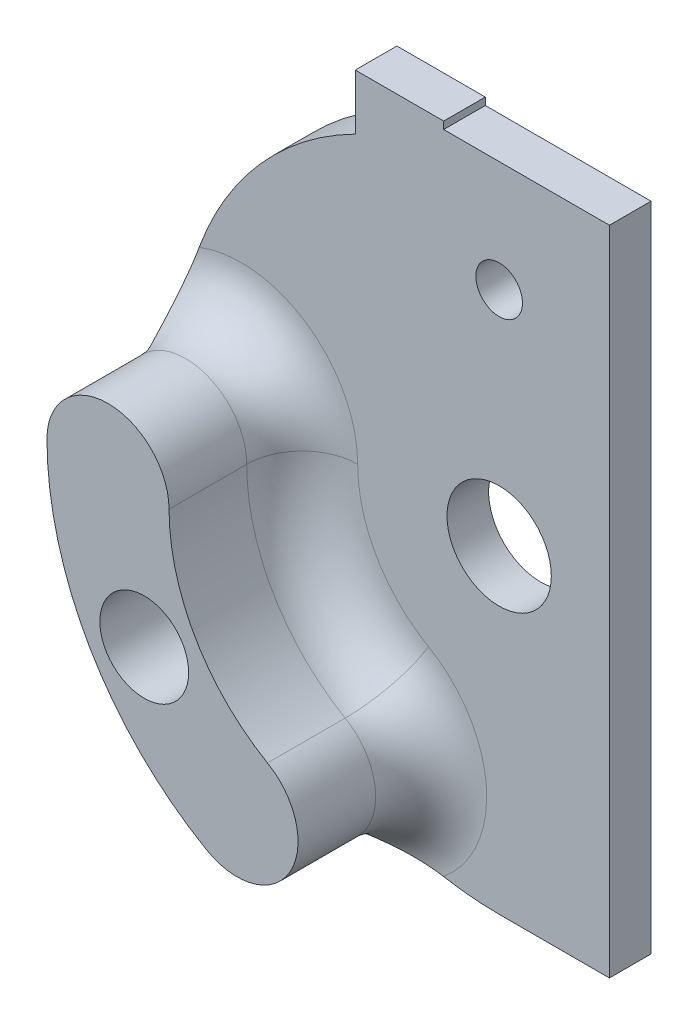
ISO-10303-21;
HEADER;
FILE_DESCRIPTION(('STEP AP214'),'2;1');
FILE_NAME('part.step','',(''),(''),'','','');
FILE_SCHEMA(('AUTOMOTIVE_DESIGN { 1 0 10303 214 1 1 1 1 }'));
ENDSEC;
DATA;
#1=APPLICATION_CONTEXT('core data for automotive mechanical design processes');
#2=APPLICATION_PROTOCOL_DEFINITION('international standard','automotive_design',2000,#1);
#3=PRODUCT_CONTEXT('',#1,'mechanical');
#4=PRODUCT('Part','Part','',(#3));
#5=PRODUCT_RELATED_PRODUCT_CATEGORY('part','',(#4));
#6=PRODUCT_DEFINITION_FORMATION('','',#4);
#7=PRODUCT_DEFINITION_CONTEXT('part definition',#1,'design');
#8=PRODUCT_DEFINITION('design','',#6,#7);
#9=PRODUCT_DEFINITION_SHAPE('','',#8);
#10=(LENGTH_UNIT() NAMED_UNIT(*) SI_UNIT(.MILLI.,.METRE.));
#11=(NAMED_UNIT(*) PLANE_ANGLE_UNIT() SI_UNIT($,.RADIAN.));
#12=(NAMED_UNIT(*) SI_UNIT($,.STERADIAN.) SOLID_ANGLE_UNIT());
#13=UNCERTAINTY_MEASURE_WITH_UNIT(LENGTH_MEASURE(1.E-05),#10,'distance_accuracy_value','');
#14=(GEOMETRIC_REPRESENTATION_CONTEXT(3) GLOBAL_UNCERTAINTY_ASSIGNED_CONTEXT((#13)) GLOBAL_UNIT_ASSIGNED_CONTEXT((#10,
#11,#12)) REPRESENTATION_CONTEXT('',''));
#15=CARTESIAN_POINT('',(0.,0.,0.));
#16=DIRECTION('',(0.,0.,1.));
#17=DIRECTION('',(1.,0.,0.));
#18=AXIS2_PLACEMENT_3D('',#15,#16,#17);
#19=CARTESIAN_POINT('',(0.,0.,4.7625));
#20=DIRECTION('',(0.,0.,-1.));
#21=DIRECTION('',(-1.,0.,0.));
#22=AXIS2_PLACEMENT_3D('',#19,#20,#21);
#23=CYLINDRICAL_SURFACE('',#22,36.5125);
#24=CARTESIAN_POINT('',(0.,0.,0.));
#25=DIRECTION('',(0.,0.,1.));
#26=DIRECTION('',(-1.,0.,0.));
#27=AXIS2_PLACEMENT_3D('',#24,#25,#26);
#28=CIRCLE('',#27,36.5125);
#29=CARTESIAN_POINT('',(-16.4676572466673,32.5880180596532,0.));
#30=VERTEX_POINT('',#29);
#31=CARTESIAN_POINT('',(-0.0815925544444594,-36.5124088346011,0.));
#32=VERTEX_POINT('',#31);
#33=EDGE_CURVE('E180',#30,#32,#28,.T.);
#34=ORIENTED_EDGE('',*,*,#33,.T.);
#35=DIRECTION('',(0.,0.,-1.));
#36=VECTOR('',#35,1.);
#37=CARTESIAN_POINT('',(-0.0815925544444594,-36.5124088346011,4.7625));
#38=LINE('',#37,#36);
#39=CARTESIAN_POINT('',(-0.0815925544444594,-36.5124088346011,4.7625));
#40=VERTEX_POINT('',#39);
#41=EDGE_CURVE('E256',#40,#32,#38,.T.);
#42=ORIENTED_EDGE('',*,*,#41,.F.);
#43=CARTESIAN_POINT('',(0.,0.,4.7625));
#44=DIRECTION('',(0.,0.,1.));
#45=DIRECTION('',(-1.,0.,0.));
#46=AXIS2_PLACEMENT_3D('',#43,#44,#45);
#47=CIRCLE('',#46,36.5125);
#48=CARTESIAN_POINT('',(-6.38944248691626,-35.9490984720951,4.7625));
#49=VERTEX_POINT('',#48);
#50=EDGE_CURVE('E193',#49,#40,#47,.T.);
#51=ORIENTED_EDGE('',*,*,#50,.F.);
#52=CARTESIAN_POINT('',(-6.38944248691626,-35.9490984720951,4.7625));
#53=CARTESIAN_POINT('',(-6.6545339060613,-35.9020014871438,4.76249052092779));
#54=CARTESIAN_POINT('',(-6.9190271908852,-35.8519482461494,4.77224529774474));
#55=CARTESIAN_POINT('',(-7.44536044638756,-35.7463407937768,4.81029895188119));
#56=CARTESIAN_POINT('',(-7.70720236473788,-35.6907910009395,4.83858303513093));
#57=CARTESIAN_POINT('',(-8.22544012186241,-35.5749197597776,4.91246271850194));
#58=CARTESIAN_POINT('',(-8.48186084629677,-35.514633210094,4.95793966788217));
#59=CARTESIAN_POINT('',(-8.99016299446811,-35.3893794261735,5.06521329952242));
#60=CARTESIAN_POINT('',(-9.24204286765562,-35.3244106295826,5.12701544761656));
#61=CARTESIAN_POINT('',(-9.87876915539309,-35.1530013454512,5.30445456861729));
#62=CARTESIAN_POINT('',(-10.2598232764579,-35.0435567990464,5.43093291758837));
#63=CARTESIAN_POINT('',(-11.0067910476253,-34.8161722324103,5.71669360293857));
#64=CARTESIAN_POINT('',(-11.3726987829703,-34.6982289417348,5.87598861196937));
#65=CARTESIAN_POINT('',(-12.0895157369509,-34.4550436978601,6.22365666363656));
#66=CARTESIAN_POINT('',(-12.4403685180986,-34.3297778433316,6.41212866790243));
#67=CARTESIAN_POINT('',(-13.1257718208696,-34.0736072573275,6.81339781991976));
#68=CARTESIAN_POINT('',(-13.4603165670407,-33.9427005586398,7.02620349739124));
#69=CARTESIAN_POINT('',(-14.1976149208928,-33.6420440838603,7.52887639142249));
#70=CARTESIAN_POINT('',(-14.5958638964103,-33.4709408998019,7.8245121086909));
#71=CARTESIAN_POINT('',(-15.3710036607559,-33.1221328685265,8.43890604067875));
#72=CARTESIAN_POINT('',(-15.747887735729,-32.9444259748398,8.75767145287072));
#73=CARTESIAN_POINT('',(-16.4844437668799,-32.5821139225435,9.41006251419565));
#74=CARTESIAN_POINT('',(-16.8441268353738,-32.3975133585686,9.74367829305017));
#75=CARTESIAN_POINT('',(-17.5516423015803,-32.0197334816489,10.4183215436118));
#76=CARTESIAN_POINT('',(-17.899476622143,-31.8265555724951,10.7593477978702));
#77=CARTESIAN_POINT('',(-18.2481027276565,-31.6254553306226,11.1044340879532));
#78=CARTESIAN_POINT('',(-18.2521765911681,-31.6231043337756,11.1084670451463));
#79=CARTESIAN_POINT('',(-18.2562499999999,-31.6207525556794,11.1125));
#80=B_SPLINE_CURVE_WITH_KNOTS('',3,(#52,#53,#54,#55,#56,#57,#58,#59,#60,#61,#62,#63,#64,#65,#66,
#67,#68,#69,#70,#71,#72,#73,#74,#75,#76,#77,#78,#79),.UNSPECIFIED.,.F.,.F.,(4,2,2,2,2,2,2,2,2,2,
2,2,2,4),(0.,0.807429189089032,1.61421449927493,2.41553078612089,3.21711570219748,
4.46359897619903,5.71056450397258,6.96185606189347,8.21358758938861,9.78626418852273,
11.359432287678,12.9315699550436,14.5034512638403,14.522038749716),.UNSPECIFIED.);
#81=CARTESIAN_POINT('',(-18.2562499999999,-31.6207525556794,11.1125));
#82=VERTEX_POINT('',#81);
#83=EDGE_CURVE('E50',#49,#82,#80,.T.);
#84=ORIENTED_EDGE('',*,*,#83,.T.);
#85=DIRECTION('',(0.,0.,-1.));
#86=VECTOR('',#85,1.);
#87=CARTESIAN_POINT('',(-18.2562499999999,-31.6207525556794,20.0025));
#88=LINE('',#87,#86);
#89=CARTESIAN_POINT('',(-18.2562499999999,-31.6207525556794,20.0025));
#90=VERTEX_POINT('',#89);
#91=EDGE_CURVE('E145',#90,#82,#88,.T.);
#92=ORIENTED_EDGE('',*,*,#91,.F.);
#93=CARTESIAN_POINT('',(0.,0.,20.0025));
#94=DIRECTION('',(0.,0.,1.));
#95=DIRECTION('',(-1.,0.,0.));
#96=AXIS2_PLACEMENT_3D('',#93,#94,#95);
#97=CIRCLE('',#96,36.5125);
#98=CARTESIAN_POINT('',(-36.5125,0.,20.0025));
#99=VERTEX_POINT('',#98);
#100=EDGE_CURVE('E152',#99,#90,#97,.T.);
#101=ORIENTED_EDGE('',*,*,#100,.F.);
#102=DIRECTION('',(0.,0.,-1.));
#103=VECTOR('',#102,1.);
#104=CARTESIAN_POINT('',(-36.5125,0.,20.0025));
#105=LINE('',#104,#103);
#106=CARTESIAN_POINT('',(-36.5125,0.,11.1125));
#107=VERTEX_POINT('',#106);
#108=EDGE_CURVE('E380',#99,#107,#105,.T.);
#109=ORIENTED_EDGE('',*,*,#108,.T.);
#110=CARTESIAN_POINT('',(-34.3275537634409,12.4411297263583,4.7625));
#111=CARTESIAN_POINT('',(-34.4193122876035,12.188005330579,4.76249052092779));
#112=CARTESIAN_POINT('',(-34.5082115517721,11.9339208062951,4.77224529774465));
#113=CARTESIAN_POINT('',(-34.6799194429389,11.4252991099897,4.81029895188074));
#114=CARTESIAN_POINT('',(-34.7627328703416,11.1707624605052,4.83858303513021));
#115=CARTESIAN_POINT('',(-34.9215043104897,10.6640197770542,4.91246271850087));
#116=CARTESIAN_POINT('',(-34.9975049891749,10.4118096407943,4.9579396678812));
#117=CARTESIAN_POINT('',(-35.143183104466,9.90898017571699,5.0652132995218));
#118=CARTESIAN_POINT('',(-35.2128584127591,9.65836140853791,5.12701544761622));
#119=CARTESIAN_POINT('',(-35.3827767621262,9.02123562603154,5.30445456861768));
#120=CARTESIAN_POINT('',(-35.4785220651667,8.63651080376886,5.43093291758928));
#121=CARTESIAN_POINT('',(-35.6550851396156,7.87592545480918,5.71669360294068));
#122=CARTESIAN_POINT('',(-35.7358971213573,7.50006841522025,5.87598861197214));
#123=CARTESIAN_POINT('',(-35.8837009993263,6.75769410127262,6.22365666363964));
#124=CARTESIAN_POINT('',(-35.9506439776515,6.39121375254728,6.41212866790495));
#125=CARTESIAN_POINT('',(-36.0714953938546,5.6695517875103,6.81339781992122));
#126=CARTESIAN_POINT('',(-36.1253992403509,5.31437418928102,7.02620349739219));
#127=CARTESIAN_POINT('',(-36.2336722723054,4.52552684728798,7.52887639142204));
#128=CARTESIAN_POINT('',(-36.2846170560012,4.09508152542898,7.82451210868939));
#129=CARTESIAN_POINT('',(-36.3701103220453,3.24938678238783,8.43890604067846));
#130=CARTESIAN_POINT('',(-36.4046536751714,2.83414215233969,8.75767145287267));
#131=CARTESIAN_POINT('',(-36.4591602493611,2.01510989189743,9.41006251418854));
#132=CARTESIAN_POINT('',(-36.479133005653,1.61131493527254,9.74367829303182));
#133=CARTESIAN_POINT('',(-36.5057237683051,0.809698629533392,10.4183215436265));
#134=CARTESIAN_POINT('',(-36.5123439518091,0.411876317077475,10.7593477979292));
#135=CARTESIAN_POINT('',(-36.5124990863974,0.00940713229352854,11.1044340879548));
#136=CARTESIAN_POINT('',(-36.5124999951595,0.004703564576973,11.1084670451471));
#137=CARTESIAN_POINT('',(-36.5125,0.,11.1125));
#138=B_SPLINE_CURVE_WITH_KNOTS('',3,(#110,#111,#112,#113,#114,#115,#116,#117,#118,#119,#120,
#121,#122,#123,#124,#125,#126,#127,#128,#129,#130,#131,#132,#133,#134,#135,#136,#137),
.UNSPECIFIED.,.F.,.F.,(4,2,2,2,2,2,2,2,2,2,2,2,2,4),(0.,0.80742918908523,1.61421449926715,
2.41553078611691,3.21711570219748,4.46359897620353,5.71056450398094,6.96185606189759,
8.21358758938862,9.7862641885217,11.3594322876729,12.9315699550405,14.5034512638407,
14.522038749716),.UNSPECIFIED.);
#139=CARTESIAN_POINT('',(-34.3275537634409,12.4411297263583,4.7625));
#140=VERTEX_POINT('',#139);
#141=EDGE_CURVE('E11',#107,#140,#138,.F.);
#142=ORIENTED_EDGE('',*,*,#141,.T.);
#143=CARTESIAN_POINT('',(-16.4676572466673,32.5880180596532,4.7625));
#144=VERTEX_POINT('',#143);
#145=EDGE_CURVE('E188',#144,#140,#47,.T.);
#146=ORIENTED_EDGE('',*,*,#145,.F.);
#147=DIRECTION('',(0.,0.,-1.));
#148=VECTOR('',#147,1.);
#149=CARTESIAN_POINT('',(-16.4676572466673,32.5880180596532,4.7625));
#150=LINE('',#149,#148);
#151=EDGE_CURVE('E211',#144,#30,#150,.T.);
#152=ORIENTED_EDGE('',*,*,#151,.T.);
#153=EDGE_LOOP('',(#34,#42,#51,#84,#92,#101,#109,#142,#146,#152));
#154=FACE_BOUND('',#153,.T.);
#155=ADVANCED_FACE('F39',(#154),#23,.T.);
#156=CARTESIAN_POINT('',(-0.0815925544444594,-36.5124088346011,4.7625));
#157=DIRECTION('',(0.,1.,0.));
#158=DIRECTION('',(0.,0.,1.));
#159=AXIS2_PLACEMENT_3D('',#156,#157,#158);
#160=PLANE('',#159);
#161=DIRECTION('',(1.,0.,0.));
#162=VECTOR('',#161,1.);
#163=CARTESIAN_POINT('',(-0.0815925544444594,-36.5124088346011,0.));
#164=LINE('',#163,#162);
#165=CARTESIAN_POINT('',(12.6184074455555,-36.5124088346011,0.));
#166=VERTEX_POINT('',#165);
#167=EDGE_CURVE('E214',#32,#166,#164,.T.);
#168=ORIENTED_EDGE('',*,*,#167,.T.);
#169=DIRECTION('',(0.,0.,-1.));
#170=VECTOR('',#169,1.);
#171=CARTESIAN_POINT('',(12.6184074455555,-36.5124088346011,4.7625));
#172=LINE('',#171,#170);
#173=CARTESIAN_POINT('',(12.6184074455555,-36.5124088346011,4.7625));
#174=VERTEX_POINT('',#173);
#175=EDGE_CURVE('E252',#174,#166,#172,.T.);
#176=ORIENTED_EDGE('',*,*,#175,.F.);
#177=DIRECTION('',(1.,0.,0.));
#178=VECTOR('',#177,1.);
#179=CARTESIAN_POINT('',(-0.0815925544444594,-36.5124088346011,4.7625));
#180=LINE('',#179,#178);
#181=EDGE_CURVE('E192',#40,#174,#180,.T.);
#182=ORIENTED_EDGE('',*,*,#181,.F.);
#183=ORIENTED_EDGE('',*,*,#41,.T.);
#184=EDGE_LOOP('',(#168,#176,#182,#183));
#185=FACE_BOUND('',#184,.T.);
#186=ADVANCED_FACE('F303',(#185),#160,.F.);
#187=CARTESIAN_POINT('',(12.6184074455555,1.58751189113899,4.7625));
#188=DIRECTION('',(-1.,0.,0.));
#189=DIRECTION('',(0.,0.,1.));
#190=AXIS2_PLACEMENT_3D('',#187,#188,#189);
#191=PLANE('',#190);
#192=DIRECTION('',(0.,1.,0.));
#193=VECTOR('',#192,1.);
#194=CARTESIAN_POINT('',(12.6184074455555,1.58751189113899,0.));
#195=LINE('',#194,#193);
#196=CARTESIAN_POINT('',(12.6184074455555,38.1,0.));
#197=VERTEX_POINT('',#196);
#198=EDGE_CURVE('E218',#166,#197,#195,.T.);
#199=ORIENTED_EDGE('',*,*,#198,.T.);
#200=DIRECTION('',(0.,0.,-1.));
#201=VECTOR('',#200,1.);
#202=CARTESIAN_POINT('',(12.6184074455555,38.1,4.7625));
#203=LINE('',#202,#201);
#204=CARTESIAN_POINT('',(12.6184074455555,38.1,4.7625));
#205=VERTEX_POINT('',#204);
#206=EDGE_CURVE('E248',#205,#197,#203,.T.);
#207=ORIENTED_EDGE('',*,*,#206,.F.);
#208=DIRECTION('',(0.,1.,0.));
#209=VECTOR('',#208,1.);
#210=CARTESIAN_POINT('',(12.6184074455555,-36.5124088346011,4.7625));
#211=LINE('',#210,#209);
#212=EDGE_CURVE('E196',#174,#205,#211,.T.);
#213=ORIENTED_EDGE('',*,*,#212,.F.);
#214=ORIENTED_EDGE('',*,*,#175,.T.);
#215=EDGE_LOOP('',(#199,#207,#213,#214));
#216=FACE_BOUND('',#215,.T.);
#217=ADVANCED_FACE('F307',(#216),#191,.F.);
#218=CARTESIAN_POINT('',(12.6184074455555,38.1,4.7625));
#219=DIRECTION('',(0.,-1.,0.));
#220=DIRECTION('',(0.,0.,-1.));
#221=AXIS2_PLACEMENT_3D('',#218,#219,#220);
#222=PLANE('',#221);
#223=DIRECTION('',(-1.,0.,0.));
#224=VECTOR('',#223,1.);
#225=CARTESIAN_POINT('',(12.6184074455555,38.1,0.));
#226=LINE('',#225,#224);
#227=CARTESIAN_POINT('',(-6.35,38.1,0.));
#228=VERTEX_POINT('',#227);
#229=EDGE_CURVE('E221',#197,#228,#226,.T.);
#230=ORIENTED_EDGE('',*,*,#229,.T.);
#231=DIRECTION('',(0.,0.,-1.));
#232=VECTOR('',#231,1.);
#233=CARTESIAN_POINT('',(-6.35,38.1,4.7625));
#234=LINE('',#233,#232);
#235=CARTESIAN_POINT('',(-6.35,38.1,4.7625));
#236=VERTEX_POINT('',#235);
#237=EDGE_CURVE('E244',#236,#228,#234,.T.);
#238=ORIENTED_EDGE('',*,*,#237,.F.);
#239=DIRECTION('',(-1.,0.,0.));
#240=VECTOR('',#239,1.);
#241=CARTESIAN_POINT('',(12.6184074455555,38.1,4.7625));
#242=LINE('',#241,#240);
#243=EDGE_CURVE('E199',#205,#236,#242,.T.);
#244=ORIENTED_EDGE('',*,*,#243,.F.);
#245=ORIENTED_EDGE('',*,*,#206,.T.);
#246=EDGE_LOOP('',(#230,#238,#244,#245));
#247=FACE_BOUND('',#246,.T.);
#248=ADVANCED_FACE('F312',(#247),#222,.F.);
#249=CARTESIAN_POINT('',(-6.35,38.1,4.7625));
#250=DIRECTION('',(-1.,0.,0.));
#251=DIRECTION('',(0.,0.,1.));
#252=AXIS2_PLACEMENT_3D('',#249,#250,#251);
#253=PLANE('',#252);
#254=DIRECTION('',(0.,1.,0.));
#255=VECTOR('',#254,1.);
#256=CARTESIAN_POINT('',(-6.35,38.1,0.));
#257=LINE('',#256,#255);
#258=CARTESIAN_POINT('',(-6.35,38.9380180596532,0.));
#259=VERTEX_POINT('',#258);
#260=EDGE_CURVE('E224',#228,#259,#257,.T.);
#261=ORIENTED_EDGE('',*,*,#260,.T.);
#262=DIRECTION('',(0.,0.,-1.));
#263=VECTOR('',#262,1.);
#264=CARTESIAN_POINT('',(-6.35,38.9380180596532,4.7625));
#265=LINE('',#264,#263);
#266=CARTESIAN_POINT('',(-6.35,38.9380180596532,4.7625));
#267=VERTEX_POINT('',#266);
#268=EDGE_CURVE('E240',#267,#259,#265,.T.);
#269=ORIENTED_EDGE('',*,*,#268,.F.);
#270=DIRECTION('',(0.,1.,0.));
#271=VECTOR('',#270,1.);
#272=CARTESIAN_POINT('',(-6.35,38.1,4.7625));
#273=LINE('',#272,#271);
#274=EDGE_CURVE('E202',#236,#267,#273,.T.);
#275=ORIENTED_EDGE('',*,*,#274,.F.);
#276=ORIENTED_EDGE('',*,*,#237,.T.);
#277=EDGE_LOOP('',(#261,#269,#275,#276));
#278=FACE_BOUND('',#277,.T.);
#279=ADVANCED_FACE('F318',(#278),#253,.F.);
#280=CARTESIAN_POINT('',(-6.35,38.9380180596532,4.7625));
#281=DIRECTION('',(0.,-1.,0.));
#282=DIRECTION('',(0.,0.,-1.));
#283=AXIS2_PLACEMENT_3D('',#280,#281,#282);
#284=PLANE('',#283);
#285=DIRECTION('',(-1.,0.,0.));
#286=VECTOR('',#285,1.);
#287=CARTESIAN_POINT('',(-6.35,38.9380180596532,0.));
#288=LINE('',#287,#286);
#289=CARTESIAN_POINT('',(-16.4676572466673,38.9380180596532,0.));
#290=VERTEX_POINT('',#289);
#291=EDGE_CURVE('E227',#259,#290,#288,.T.);
#292=ORIENTED_EDGE('',*,*,#291,.T.);
#293=DIRECTION('',(0.,0.,-1.));
#294=VECTOR('',#293,1.);
#295=CARTESIAN_POINT('',(-16.4676572466673,38.9380180596532,4.7625));
#296=LINE('',#295,#294);
#297=CARTESIAN_POINT('',(-16.4676572466673,38.9380180596532,4.7625));
#298=VERTEX_POINT('',#297);
#299=EDGE_CURVE('E236',#298,#290,#296,.T.);
#300=ORIENTED_EDGE('',*,*,#299,.F.);
#301=DIRECTION('',(-1.,0.,0.));
#302=VECTOR('',#301,1.);
#303=CARTESIAN_POINT('',(-6.35,38.9380180596532,4.7625));
#304=LINE('',#303,#302);
#305=EDGE_CURVE('E205',#267,#298,#304,.T.);
#306=ORIENTED_EDGE('',*,*,#305,.F.);
#307=ORIENTED_EDGE('',*,*,#268,.T.);
#308=EDGE_LOOP('',(#292,#300,#306,#307));
#309=FACE_BOUND('',#308,.T.);
#310=ADVANCED_FACE('F322',(#309),#284,.F.);
#311=CARTESIAN_POINT('',(-16.4676572466673,32.5880180596532,4.7625));
#312=DIRECTION('',(1.,0.,0.));
#313=DIRECTION('',(0.,0.,-1.));
#314=AXIS2_PLACEMENT_3D('',#311,#312,#313);
#315=PLANE('',#314);
#316=DIRECTION('',(0.,-1.,0.));
#317=VECTOR('',#316,1.);
#318=CARTESIAN_POINT('',(-16.4676572466673,32.5880180596532,0.));
#319=LINE('',#318,#317);
#320=EDGE_CURVE('E230',#290,#30,#319,.T.);
#321=ORIENTED_EDGE('',*,*,#320,.T.);
#322=ORIENTED_EDGE('',*,*,#151,.F.);
#323=DIRECTION('',(0.,-1.,0.));
#324=VECTOR('',#323,1.);
#325=CARTESIAN_POINT('',(-16.4676572466673,32.5880180596532,4.7625));
#326=LINE('',#325,#324);
#327=EDGE_CURVE('E208',#298,#144,#326,.T.);
#328=ORIENTED_EDGE('',*,*,#327,.F.);
#329=ORIENTED_EDGE('',*,*,#299,.T.);
#330=EDGE_LOOP('',(#321,#322,#328,#329));
#331=FACE_BOUND('',#330,.T.);
#332=ADVANCED_FACE('F326',(#331),#315,.F.);
#333=CARTESIAN_POINT('',(0.,0.,4.7625));
#334=DIRECTION('',(0.,0.,-1.));
#335=DIRECTION('',(-1.,0.,0.));
#336=AXIS2_PLACEMENT_3D('',#333,#334,#335);
#337=PLANE('',#336);
#338=CARTESIAN_POINT('',(0.,0.,4.7625));
#339=DIRECTION('',(0.,0.,-1.));
#340=DIRECTION('',(-1.,0.,0.));
#341=AXIS2_PLACEMENT_3D('',#338,#339,#340);
#342=CIRCLE('',#341,16.1925);
#343=CARTESIAN_POINT('',(-16.1925,0.,4.7625));
#344=VERTEX_POINT('',#343);
#345=CARTESIAN_POINT('',(-8.09624999999996,-14.0231163507795,4.7625));
#346=VERTEX_POINT('',#345);
#347=EDGE_CURVE('E263',#344,#346,#342,.F.);
#348=ORIENTED_EDGE('',*,*,#347,.T.);
#349=CARTESIAN_POINT('',(-14.7637499999999,-25.5715651102451,4.7625));
#350=DIRECTION('',(0.,0.,-1.));
#351=DIRECTION('',(-1.,0.,0.));
#352=AXIS2_PLACEMENT_3D('',#349,#350,#351);
#353=CIRCLE('',#352,13.335);
#354=EDGE_CURVE('E269',#346,#49,#353,.T.);
#355=ORIENTED_EDGE('',*,*,#354,.T.);
#356=ORIENTED_EDGE('',*,*,#50,.T.);
#357=ORIENTED_EDGE('',*,*,#181,.T.);
#358=ORIENTED_EDGE('',*,*,#212,.T.);
#359=ORIENTED_EDGE('',*,*,#243,.T.);
#360=ORIENTED_EDGE('',*,*,#274,.T.);
#361=ORIENTED_EDGE('',*,*,#305,.T.);
#362=ORIENTED_EDGE('',*,*,#327,.T.);
#363=ORIENTED_EDGE('',*,*,#145,.T.);
#364=CARTESIAN_POINT('',(-29.5275,0.,4.7625));
#365=DIRECTION('',(0.,0.,-1.));
#366=DIRECTION('',(-1.,0.,0.));
#367=AXIS2_PLACEMENT_3D('',#364,#365,#366);
#368=CIRCLE('',#367,13.335);
#369=EDGE_CURVE('E266',#140,#344,#368,.T.);
#370=ORIENTED_EDGE('',*,*,#369,.T.);
#371=EDGE_LOOP('',(#348,#355,#356,#357,#358,#359,#360,#361,#362,#363,#370));
#372=FACE_BOUND('',#371,.T.);
#373=CARTESIAN_POINT('',(0.,0.,4.7625));
#374=DIRECTION('',(0.,0.,1.));
#375=DIRECTION('',(1.,0.,0.));
#376=AXIS2_PLACEMENT_3D('',#373,#374,#375);
#377=CIRCLE('',#376,5.969);
#378=CARTESIAN_POINT('',(5.969,0.,4.7625));
#379=VERTEX_POINT('',#378);
#380=EDGE_CURVE('E181',#379,#379,#377,.T.);
#381=ORIENTED_EDGE('',*,*,#380,.F.);
#382=EDGE_LOOP('',(#381));
#383=FACE_BOUND('',#382,.T.);
#384=CARTESIAN_POINT('',(0.,25.4,4.7625));
#385=DIRECTION('',(0.,0.,1.));
#386=DIRECTION('',(1.,0.,0.));
#387=AXIS2_PLACEMENT_3D('',#384,#385,#386);
#388=CIRCLE('',#387,2.667);
#389=CARTESIAN_POINT('',(2.667,25.4,4.7625));
#390=VERTEX_POINT('',#389);
#391=EDGE_CURVE('E165',#390,#390,#388,.T.);
#392=ORIENTED_EDGE('',*,*,#391,.F.);
#393=EDGE_LOOP('',(#392));
#394=FACE_BOUND('',#393,.T.);
#395=ADVANCED_FACE('F330',(#372,#383,#394),#337,.F.);
#396=CARTESIAN_POINT('',(0.,0.,0.));
#397=DIRECTION('',(0.,0.,-1.));
#398=DIRECTION('',(-1.,0.,0.));
#399=AXIS2_PLACEMENT_3D('',#396,#397,#398);
#400=PLANE('',#399);
#401=CARTESIAN_POINT('',(-25.3812347219415,-15.0886109446732,0.));
#402=DIRECTION('',(0.,0.,-1.));
#403=DIRECTION('',(-1.,0.,0.));
#404=AXIS2_PLACEMENT_3D('',#401,#402,#403);
#405=CIRCLE('',#404,5.08);
#406=CARTESIAN_POINT('',(-30.4612347219415,-15.0886109446732,0.));
#407=VERTEX_POINT('',#406);
#408=EDGE_CURVE('E368',#407,#407,#405,.F.);
#409=ORIENTED_EDGE('',*,*,#408,.T.);
#410=EDGE_LOOP('',(#409));
#411=FACE_BOUND('',#410,.T.);
#412=CARTESIAN_POINT('',(0.,0.,0.));
#413=DIRECTION('',(0.,0.,1.));
#414=DIRECTION('',(1.,0.,0.));
#415=AXIS2_PLACEMENT_3D('',#412,#413,#414);
#416=CIRCLE('',#415,5.969);
#417=CARTESIAN_POINT('',(5.969,0.,0.));
#418=VERTEX_POINT('',#417);
#419=EDGE_CURVE('E176',#418,#418,#416,.T.);
#420=ORIENTED_EDGE('',*,*,#419,.T.);
#421=EDGE_LOOP('',(#420));
#422=FACE_BOUND('',#421,.T.);
#423=CARTESIAN_POINT('',(0.,25.4,0.));
#424=DIRECTION('',(0.,0.,1.));
#425=DIRECTION('',(1.,0.,0.));
#426=AXIS2_PLACEMENT_3D('',#423,#424,#425);
#427=CIRCLE('',#426,2.667);
#428=CARTESIAN_POINT('',(2.667,25.4,0.));
#429=VERTEX_POINT('',#428);
#430=EDGE_CURVE('E170',#429,#429,#427,.T.);
#431=ORIENTED_EDGE('',*,*,#430,.T.);
#432=EDGE_LOOP('',(#431));
#433=FACE_BOUND('',#432,.T.);
#434=ORIENTED_EDGE('',*,*,#33,.F.);
#435=ORIENTED_EDGE('',*,*,#320,.F.);
#436=ORIENTED_EDGE('',*,*,#291,.F.);
#437=ORIENTED_EDGE('',*,*,#260,.F.);
#438=ORIENTED_EDGE('',*,*,#229,.F.);
#439=ORIENTED_EDGE('',*,*,#198,.F.);
#440=ORIENTED_EDGE('',*,*,#167,.F.);
#441=EDGE_LOOP('',(#434,#435,#436,#437,#438,#439,#440));
#442=FACE_BOUND('',#441,.T.);
#443=ADVANCED_FACE('F332',(#411,#422,#433,#442),#400,.T.);
#444=CARTESIAN_POINT('',(0.,25.4,0.));
#445=DIRECTION('',(0.,0.,1.));
#446=DIRECTION('',(1.,0.,0.));
#447=AXIS2_PLACEMENT_3D('',#444,#445,#446);
#448=CYLINDRICAL_SURFACE('',#447,2.667);
#449=CARTESIAN_POINT('',(2.667,25.4,0.));
#450=CARTESIAN_POINT('',(2.667,25.4,0.049609375));
#451=CARTESIAN_POINT('',(2.667,25.4,0.09921875));
#452=CARTESIAN_POINT('',(2.667,25.4,0.1984375));
#453=CARTESIAN_POINT('',(2.667,25.4,0.248046875));
#454=CARTESIAN_POINT('',(2.667,25.4,0.347265625));
#455=CARTESIAN_POINT('',(2.667,25.4,0.396875));
#456=CARTESIAN_POINT('',(2.667,25.4,0.49609375));
#457=CARTESIAN_POINT('',(2.667,25.4,0.545703125));
#458=CARTESIAN_POINT('',(2.667,25.4,0.644921875));
#459=CARTESIAN_POINT('',(2.667,25.4,0.69453125));
#460=CARTESIAN_POINT('',(2.667,25.4,0.79375));
#461=CARTESIAN_POINT('',(2.667,25.4,0.843359375));
#462=CARTESIAN_POINT('',(2.667,25.4,0.942578125));
#463=CARTESIAN_POINT('',(2.667,25.4,0.9921875));
#464=CARTESIAN_POINT('',(2.667,25.4,1.09140625));
#465=CARTESIAN_POINT('',(2.667,25.4,1.141015625));
#466=CARTESIAN_POINT('',(2.667,25.4,1.240234375));
#467=CARTESIAN_POINT('',(2.667,25.4,1.28984375));
#468=CARTESIAN_POINT('',(2.667,25.4,1.3890625));
#469=CARTESIAN_POINT('',(2.667,25.4,1.438671875));
#470=CARTESIAN_POINT('',(2.667,25.4,1.537890625));
#471=CARTESIAN_POINT('',(2.667,25.4,1.5875));
#472=CARTESIAN_POINT('',(2.667,25.4,1.68671875));
#473=CARTESIAN_POINT('',(2.667,25.4,1.736328125));
#474=CARTESIAN_POINT('',(2.667,25.4,1.835546875));
#475=CARTESIAN_POINT('',(2.667,25.4,1.88515625));
#476=CARTESIAN_POINT('',(2.667,25.4,1.984375));
#477=CARTESIAN_POINT('',(2.667,25.4,2.033984375));
#478=CARTESIAN_POINT('',(2.667,25.4,2.133203125));
#479=CARTESIAN_POINT('',(2.667,25.4,2.1828125));
#480=CARTESIAN_POINT('',(2.667,25.4,2.28203125));
#481=CARTESIAN_POINT('',(2.667,25.4,2.331640625));
#482=CARTESIAN_POINT('',(2.667,25.4,2.430859375));
#483=CARTESIAN_POINT('',(2.667,25.4,2.48046875));
#484=CARTESIAN_POINT('',(2.667,25.4,2.5796875));
#485=CARTESIAN_POINT('',(2.667,25.4,2.629296875));
#486=CARTESIAN_POINT('',(2.667,25.4,2.728515625));
#487=CARTESIAN_POINT('',(2.667,25.4,2.778125));
#488=CARTESIAN_POINT('',(2.667,25.4,2.87734375));
#489=CARTESIAN_POINT('',(2.667,25.4,2.926953125));
#490=CARTESIAN_POINT('',(2.667,25.4,3.026171875));
#491=CARTESIAN_POINT('',(2.667,25.4,3.07578125));
#492=CARTESIAN_POINT('',(2.667,25.4,3.175));
#493=CARTESIAN_POINT('',(2.667,25.4,3.224609375));
#494=CARTESIAN_POINT('',(2.667,25.4,3.323828125));
#495=CARTESIAN_POINT('',(2.667,25.4,3.3734375));
#496=CARTESIAN_POINT('',(2.667,25.4,3.47265625));
#497=CARTESIAN_POINT('',(2.667,25.4,3.522265625));
#498=CARTESIAN_POINT('',(2.667,25.4,3.621484375));
#499=CARTESIAN_POINT('',(2.667,25.4,3.67109375));
#500=CARTESIAN_POINT('',(2.667,25.4,3.7703125));
#501=CARTESIAN_POINT('',(2.667,25.4,3.819921875));
#502=CARTESIAN_POINT('',(2.667,25.4,3.919140625));
#503=CARTESIAN_POINT('',(2.667,25.4,3.96875));
#504=CARTESIAN_POINT('',(2.667,25.4,4.06796875));
#505=CARTESIAN_POINT('',(2.667,25.4,4.117578125));
#506=CARTESIAN_POINT('',(2.667,25.4,4.216796875));
#507=CARTESIAN_POINT('',(2.667,25.4,4.26640625));
#508=CARTESIAN_POINT('',(2.667,25.4,4.365625));
#509=CARTESIAN_POINT('',(2.667,25.4,4.415234375));
#510=CARTESIAN_POINT('',(2.667,25.4,4.514453125));
#511=CARTESIAN_POINT('',(2.667,25.4,4.5640625));
#512=CARTESIAN_POINT('',(2.667,25.4,4.66328125));
#513=CARTESIAN_POINT('',(2.667,25.4,4.712890625));
#514=CARTESIAN_POINT('',(2.667,25.4,4.7625));
#515=B_SPLINE_CURVE_WITH_KNOTS('',3,(#449,#450,#451,#452,#453,#454,#455,#456,#457,#458,#459,
#460,#461,#462,#463,#464,#465,#466,#467,#468,#469,#470,#471,#472,#473,#474,#475,#476,#477,#478,
#479,#480,#481,#482,#483,#484,#485,#486,#487,#488,#489,#490,#491,#492,#493,#494,#495,#496,#497,
#498,#499,#500,#501,#502,#503,#504,#505,#506,#507,#508,#509,#510,#511,#512,#513,#514),
.UNSPECIFIED.,.F.,.F.,(4,2,2,2,2,2,2,2,2,2,2,2,2,2,2,2,2,2,2,2,2,2,2,2,2,2,2,2,2,2,2,2,4),(0.,
0.148828125,0.29765625,0.446484375,0.5953125,0.744140625,0.89296875,1.041796875,1.190625,
1.339453125,1.48828125,1.637109375,1.7859375,1.934765625,2.08359375,2.232421875,2.38125,
2.530078125,2.67890625,2.827734375,2.9765625,3.125390625,3.27421875,3.423046875,3.571875,
3.720703125,3.86953125,4.018359375,4.1671875,4.316015625,4.46484375,4.613671875,4.7625),.UNSPECIFIED.);
#516=EDGE_CURVE('BSEAM335',#429,#390,#515,.T.);
#517=ORIENTED_EDGE('',*,*,#430,.F.);
#518=ORIENTED_EDGE('',*,*,#391,.T.);
#519=ORIENTED_EDGE('',*,*,#516,.T.);
#520=ORIENTED_EDGE('',*,*,#516,.F.);
#521=EDGE_LOOP('',(#517,#519,#518,#520));
#522=FACE_BOUND('',#521,.T.);
#523=ADVANCED_FACE('F335',(#522),#448,.F.);
#524=CARTESIAN_POINT('',(0.,0.,0.));
#525=DIRECTION('',(0.,0.,1.));
#526=DIRECTION('',(1.,0.,0.));
#527=AXIS2_PLACEMENT_3D('',#524,#525,#526);
#528=CYLINDRICAL_SURFACE('',#527,5.969);
#529=CARTESIAN_POINT('',(5.969,0.,0.));
#530=CARTESIAN_POINT('',(5.969,0.,0.049609375));
#531=CARTESIAN_POINT('',(5.969,0.,0.09921875));
#532=CARTESIAN_POINT('',(5.969,0.,0.1984375));
#533=CARTESIAN_POINT('',(5.969,0.,0.248046875));
#534=CARTESIAN_POINT('',(5.969,0.,0.347265625));
#535=CARTESIAN_POINT('',(5.969,0.,0.396875));
#536=CARTESIAN_POINT('',(5.969,0.,0.49609375));
#537=CARTESIAN_POINT('',(5.969,0.,0.545703125));
#538=CARTESIAN_POINT('',(5.969,0.,0.644921875));
#539=CARTESIAN_POINT('',(5.969,0.,0.69453125));
#540=CARTESIAN_POINT('',(5.969,0.,0.79375));
#541=CARTESIAN_POINT('',(5.969,0.,0.843359375));
#542=CARTESIAN_POINT('',(5.969,0.,0.942578125));
#543=CARTESIAN_POINT('',(5.969,0.,0.9921875));
#544=CARTESIAN_POINT('',(5.969,0.,1.09140625));
#545=CARTESIAN_POINT('',(5.969,0.,1.141015625));
#546=CARTESIAN_POINT('',(5.969,0.,1.240234375));
#547=CARTESIAN_POINT('',(5.969,0.,1.28984375));
#548=CARTESIAN_POINT('',(5.969,0.,1.3890625));
#549=CARTESIAN_POINT('',(5.969,0.,1.438671875));
#550=CARTESIAN_POINT('',(5.969,0.,1.537890625));
#551=CARTESIAN_POINT('',(5.969,0.,1.5875));
#552=CARTESIAN_POINT('',(5.969,0.,1.68671875));
#553=CARTESIAN_POINT('',(5.969,0.,1.736328125));
#554=CARTESIAN_POINT('',(5.969,0.,1.835546875));
#555=CARTESIAN_POINT('',(5.969,0.,1.88515625));
#556=CARTESIAN_POINT('',(5.969,0.,1.984375));
#557=CARTESIAN_POINT('',(5.969,0.,2.033984375));
#558=CARTESIAN_POINT('',(5.969,0.,2.133203125));
#559=CARTESIAN_POINT('',(5.969,0.,2.1828125));
#560=CARTESIAN_POINT('',(5.969,0.,2.28203125));
#561=CARTESIAN_POINT('',(5.969,0.,2.331640625));
#562=CARTESIAN_POINT('',(5.969,0.,2.430859375));
#563=CARTESIAN_POINT('',(5.969,0.,2.48046875));
#564=CARTESIAN_POINT('',(5.969,0.,2.5796875));
#565=CARTESIAN_POINT('',(5.969,0.,2.629296875));
#566=CARTESIAN_POINT('',(5.969,0.,2.728515625));
#567=CARTESIAN_POINT('',(5.969,0.,2.778125));
#568=CARTESIAN_POINT('',(5.969,0.,2.87734375));
#569=CARTESIAN_POINT('',(5.969,0.,2.926953125));
#570=CARTESIAN_POINT('',(5.969,0.,3.026171875));
#571=CARTESIAN_POINT('',(5.969,0.,3.07578125));
#572=CARTESIAN_POINT('',(5.969,0.,3.175));
#573=CARTESIAN_POINT('',(5.969,0.,3.224609375));
#574=CARTESIAN_POINT('',(5.969,0.,3.323828125));
#575=CARTESIAN_POINT('',(5.969,0.,3.3734375));
#576=CARTESIAN_POINT('',(5.969,0.,3.47265625));
#577=CARTESIAN_POINT('',(5.969,0.,3.522265625));
#578=CARTESIAN_POINT('',(5.969,0.,3.621484375));
#579=CARTESIAN_POINT('',(5.969,0.,3.67109375));
#580=CARTESIAN_POINT('',(5.969,0.,3.7703125));
#581=CARTESIAN_POINT('',(5.969,0.,3.819921875));
#582=CARTESIAN_POINT('',(5.969,0.,3.919140625));
#583=CARTESIAN_POINT('',(5.969,0.,3.96875));
#584=CARTESIAN_POINT('',(5.969,0.,4.06796875));
#585=CARTESIAN_POINT('',(5.969,0.,4.117578125));
#586=CARTESIAN_POINT('',(5.969,0.,4.216796875));
#587=CARTESIAN_POINT('',(5.969,0.,4.26640625));
#588=CARTESIAN_POINT('',(5.969,0.,4.365625));
#589=CARTESIAN_POINT('',(5.969,0.,4.415234375));
#590=CARTESIAN_POINT('',(5.969,0.,4.514453125));
#591=CARTESIAN_POINT('',(5.969,0.,4.5640625));
#592=CARTESIAN_POINT('',(5.969,0.,4.66328125));
#593=CARTESIAN_POINT('',(5.969,0.,4.712890625));
#594=CARTESIAN_POINT('',(5.969,0.,4.7625));
#595=B_SPLINE_CURVE_WITH_KNOTS('',3,(#529,#530,#531,#532,#533,#534,#535,#536,#537,#538,#539,
#540,#541,#542,#543,#544,#545,#546,#547,#548,#549,#550,#551,#552,#553,#554,#555,#556,#557,#558,
#559,#560,#561,#562,#563,#564,#565,#566,#567,#568,#569,#570,#571,#572,#573,#574,#575,#576,#577,
#578,#579,#580,#581,#582,#583,#584,#585,#586,#587,#588,#589,#590,#591,#592,#593,#594),
.UNSPECIFIED.,.F.,.F.,(4,2,2,2,2,2,2,2,2,2,2,2,2,2,2,2,2,2,2,2,2,2,2,2,2,2,2,2,2,2,2,2,4),(0.,
0.148828125,0.29765625,0.446484375,0.5953125,0.744140625,0.89296875,1.041796875,1.190625,
1.339453125,1.48828125,1.637109375,1.7859375,1.934765625,2.08359375,2.232421875,2.38125,
2.530078125,2.67890625,2.827734375,2.9765625,3.125390625,3.27421875,3.423046875,3.571875,
3.720703125,3.86953125,4.018359375,4.1671875,4.316015625,4.46484375,4.613671875,4.7625),.UNSPECIFIED.);
#596=EDGE_CURVE('BSEAM342',#418,#379,#595,.T.);
#597=ORIENTED_EDGE('',*,*,#419,.F.);
#598=ORIENTED_EDGE('',*,*,#380,.T.);
#599=ORIENTED_EDGE('',*,*,#596,.T.);
#600=ORIENTED_EDGE('',*,*,#596,.F.);
#601=EDGE_LOOP('',(#597,#599,#598,#600));
#602=FACE_BOUND('',#601,.T.);
#603=ADVANCED_FACE('F342',(#602),#528,.F.);
#604=CARTESIAN_POINT('',(-14.7637499999999,-25.5715651102451,20.0025));
#605=DIRECTION('',(0.,0.,-1.));
#606=DIRECTION('',(-1.,0.,0.));
#607=AXIS2_PLACEMENT_3D('',#604,#605,#606);
#608=CYLINDRICAL_SURFACE('',#607,6.985);
#609=ORIENTED_EDGE('',*,*,#91,.T.);
#610=CARTESIAN_POINT('',(-14.7637499999999,-25.5715651102451,11.1125));
#611=DIRECTION('',(0.,0.,-1.));
#612=DIRECTION('',(-1.,0.,0.));
#613=AXIS2_PLACEMENT_3D('',#610,#611,#612);
#614=CIRCLE('',#613,6.985);
#615=CARTESIAN_POINT('',(-11.27125,-19.5223776648107,11.1125));
#616=VERTEX_POINT('',#615);
#617=EDGE_CURVE('E260',#82,#616,#614,.F.);
#618=ORIENTED_EDGE('',*,*,#617,.T.);
#619=DIRECTION('',(0.,0.,-1.));
#620=VECTOR('',#619,1.);
#621=CARTESIAN_POINT('',(-11.27125,-19.5223776648107,20.0025));
#622=LINE('',#621,#620);
#623=CARTESIAN_POINT('',(-11.27125,-19.5223776648107,20.0025));
#624=VERTEX_POINT('',#623);
#625=EDGE_CURVE('E147',#624,#616,#622,.T.);
#626=ORIENTED_EDGE('',*,*,#625,.F.);
#627=CARTESIAN_POINT('',(-14.7637499999999,-25.5715651102451,20.0025));
#628=DIRECTION('',(0.,0.,1.));
#629=DIRECTION('',(-1.,0.,0.));
#630=AXIS2_PLACEMENT_3D('',#627,#628,#629);
#631=CIRCLE('',#630,6.985);
#632=EDGE_CURVE('E140',#90,#624,#631,.T.);
#633=ORIENTED_EDGE('',*,*,#632,.F.);
#634=EDGE_LOOP('',(#609,#618,#626,#633));
#635=FACE_BOUND('',#634,.T.);
#636=ADVANCED_FACE('F142',(#635),#608,.T.);
#637=CARTESIAN_POINT('',(0.,0.,20.0025));
#638=DIRECTION('',(0.,0.,-1.));
#639=DIRECTION('',(-1.,0.,0.));
#640=AXIS2_PLACEMENT_3D('',#637,#638,#639);
#641=CYLINDRICAL_SURFACE('',#640,22.5425);
#642=ORIENTED_EDGE('',*,*,#625,.T.);
#643=CARTESIAN_POINT('',(0.,0.,11.1125));
#644=DIRECTION('',(0.,0.,-1.));
#645=DIRECTION('',(-1.,0.,0.));
#646=AXIS2_PLACEMENT_3D('',#643,#644,#645);
#647=CIRCLE('',#646,22.5425);
#648=CARTESIAN_POINT('',(-22.5425,0.,11.1125));
#649=VERTEX_POINT('',#648);
#650=EDGE_CURVE('E58',#616,#649,#647,.T.);
#651=ORIENTED_EDGE('',*,*,#650,.T.);
#652=DIRECTION('',(0.,0.,-1.));
#653=VECTOR('',#652,1.);
#654=CARTESIAN_POINT('',(-22.5425,0.,20.0025));
#655=LINE('',#654,#653);
#656=CARTESIAN_POINT('',(-22.5425,0.,20.0025));
#657=VERTEX_POINT('',#656);
#658=EDGE_CURVE('E172',#657,#649,#655,.T.);
#659=ORIENTED_EDGE('',*,*,#658,.F.);
#660=CARTESIAN_POINT('',(0.,0.,20.0025));
#661=DIRECTION('',(0.,0.,-1.));
#662=DIRECTION('',(-1.,0.,0.));
#663=AXIS2_PLACEMENT_3D('',#660,#661,#662);
#664=CIRCLE('',#663,22.5425);
#665=EDGE_CURVE('E151',#624,#657,#664,.T.);
#666=ORIENTED_EDGE('',*,*,#665,.F.);
#667=EDGE_LOOP('',(#642,#651,#659,#666));
#668=FACE_BOUND('',#667,.T.);
#669=ADVANCED_FACE('F349',(#668),#641,.F.);
#670=CARTESIAN_POINT('',(-29.5275,0.,20.0025));
#671=DIRECTION('',(0.,0.,-1.));
#672=DIRECTION('',(-1.,0.,0.));
#673=AXIS2_PLACEMENT_3D('',#670,#671,#672);
#674=CYLINDRICAL_SURFACE('',#673,6.985);
#675=ORIENTED_EDGE('',*,*,#658,.T.);
#676=CARTESIAN_POINT('',(-29.5275,0.,11.1125));
#677=DIRECTION('',(0.,0.,-1.));
#678=DIRECTION('',(-1.,0.,0.));
#679=AXIS2_PLACEMENT_3D('',#676,#677,#678);
#680=CIRCLE('',#679,6.985);
#681=EDGE_CURVE('E65',#649,#107,#680,.F.);
#682=ORIENTED_EDGE('',*,*,#681,.T.);
#683=ORIENTED_EDGE('',*,*,#108,.F.);
#684=CARTESIAN_POINT('',(-29.5275,0.,20.0025));
#685=DIRECTION('',(0.,0.,1.));
#686=DIRECTION('',(-1.,0.,0.));
#687=AXIS2_PLACEMENT_3D('',#684,#685,#686);
#688=CIRCLE('',#687,6.985);
#689=EDGE_CURVE('E157',#657,#99,#688,.T.);
#690=ORIENTED_EDGE('',*,*,#689,.F.);
#691=EDGE_LOOP('',(#675,#682,#683,#690));
#692=FACE_BOUND('',#691,.T.);
#693=ADVANCED_FACE('F352',(#692),#674,.T.);
#694=CARTESIAN_POINT('',(-14.76375,0.,20.0025));
#695=DIRECTION('',(0.,0.,-1.));
#696=DIRECTION('',(-1.,0.,0.));
#697=AXIS2_PLACEMENT_3D('',#694,#695,#696);
#698=PLANE('',#697);
#699=CARTESIAN_POINT('',(-25.3812347219415,-15.0886109446732,20.0025));
#700=DIRECTION('',(0.,0.,1.));
#701=DIRECTION('',(1.,0.,0.));
#702=AXIS2_PLACEMENT_3D('',#699,#700,#701);
#703=CIRCLE('',#702,5.08);
#704=CARTESIAN_POINT('',(-20.3012347219415,-15.0886109446732,20.0025));
#705=VERTEX_POINT('',#704);
#706=EDGE_CURVE('E365',#705,#705,#703,.T.);
#707=ORIENTED_EDGE('',*,*,#706,.F.);
#708=EDGE_LOOP('',(#707));
#709=FACE_BOUND('',#708,.T.);
#710=ORIENTED_EDGE('',*,*,#100,.T.);
#711=ORIENTED_EDGE('',*,*,#632,.T.);
#712=ORIENTED_EDGE('',*,*,#665,.T.);
#713=ORIENTED_EDGE('',*,*,#689,.T.);
#714=EDGE_LOOP('',(#710,#711,#712,#713));
#715=FACE_BOUND('',#714,.T.);
#716=ADVANCED_FACE('F155',(#709,#715),#698,.F.);
#717=CARTESIAN_POINT('',(-29.5275,0.,11.1125));
#718=DIRECTION('',(0.,0.,-1.));
#719=DIRECTION('',(-1.,0.,0.));
#720=AXIS2_PLACEMENT_3D('',#717,#718,#719);
#721=TOROIDAL_SURFACE('',#720,13.335,6.35);
#722=ORIENTED_EDGE('',*,*,#141,.F.);
#723=ORIENTED_EDGE('',*,*,#681,.F.);
#724=CARTESIAN_POINT('',(-16.1925,0.,11.1125));
#725=DIRECTION('',(0.,1.,0.));
#726=DIRECTION('',(-1.,0.,0.));
#727=AXIS2_PLACEMENT_3D('',#724,#725,#726);
#728=CIRCLE('',#727,6.35);
#729=EDGE_CURVE('E44',#344,#649,#728,.T.);
#730=ORIENTED_EDGE('',*,*,#729,.F.);
#731=ORIENTED_EDGE('',*,*,#369,.F.);
#732=EDGE_LOOP('',(#722,#723,#730,#731));
#733=FACE_BOUND('',#732,.T.);
#734=ADVANCED_FACE('F41',(#733),#721,.F.);
#735=CARTESIAN_POINT('',(0.,0.,11.1125));
#736=DIRECTION('',(0.,0.,-1.));
#737=DIRECTION('',(-1.,0.,0.));
#738=AXIS2_PLACEMENT_3D('',#735,#736,#737);
#739=TOROIDAL_SURFACE('',#738,16.1925,6.35);
#740=ORIENTED_EDGE('',*,*,#729,.T.);
#741=ORIENTED_EDGE('',*,*,#650,.F.);
#742=CARTESIAN_POINT('',(-8.09624999999996,-14.0231163507795,11.1125));
#743=DIRECTION('',(-0.86602540378444,0.499999999999997,0.));
#744=DIRECTION('',(-0.499999999999997,-0.86602540378444,0.));
#745=AXIS2_PLACEMENT_3D('',#742,#743,#744);
#746=CIRCLE('',#745,6.35);
#747=EDGE_CURVE('E370',#346,#616,#746,.T.);
#748=ORIENTED_EDGE('',*,*,#747,.F.);
#749=ORIENTED_EDGE('',*,*,#347,.F.);
#750=EDGE_LOOP('',(#740,#741,#748,#749));
#751=FACE_BOUND('',#750,.T.);
#752=ADVANCED_FACE('F293',(#751),#739,.F.);
#753=CARTESIAN_POINT('',(-14.7637499999999,-25.5715651102451,11.1125));
#754=DIRECTION('',(0.,0.,-1.));
#755=DIRECTION('',(-1.,0.,0.));
#756=AXIS2_PLACEMENT_3D('',#753,#754,#755);
#757=TOROIDAL_SURFACE('',#756,13.335,6.35);
#758=ORIENTED_EDGE('',*,*,#83,.F.);
#759=ORIENTED_EDGE('',*,*,#354,.F.);
#760=ORIENTED_EDGE('',*,*,#747,.T.);
#761=ORIENTED_EDGE('',*,*,#617,.F.);
#762=EDGE_LOOP('',(#758,#759,#760,#761));
#763=FACE_BOUND('',#762,.T.);
#764=ADVANCED_FACE('F289',(#763),#757,.F.);
#765=CARTESIAN_POINT('',(-25.3812347219415,-15.0886109446732,-14.3684097937107));
#766=DIRECTION('',(0.,0.,1.));
#767=DIRECTION('',(1.,0.,0.));
#768=AXIS2_PLACEMENT_3D('',#765,#766,#767);
#769=CYLINDRICAL_SURFACE('',#768,5.08);
#770=ORIENTED_EDGE('',*,*,#706,.T.);
#771=EDGE_LOOP('',(#770));
#772=FACE_BOUND('',#771,.T.);
#773=ORIENTED_EDGE('',*,*,#408,.F.);
#774=EDGE_LOOP('',(#773));
#775=FACE_BOUND('',#774,.T.);
#776=ADVANCED_FACE('F292',(#772,#775),#769,.F.);
#777=CLOSED_SHELL('',(#155,#186,#217,#248,#279,#310,#332,#395,#443,#523,#603,#636,#669,#693,
#716,#734,#752,#764,#776));
#778=MANIFOLD_SOLID_BREP('B2',#777);
#779=ADVANCED_BREP_SHAPE_REPRESENTATION('',(#18,#778),#14);
#780=SHAPE_DEFINITION_REPRESENTATION(#9,#779);
ENDSEC;
END-ISO-10303-21;
